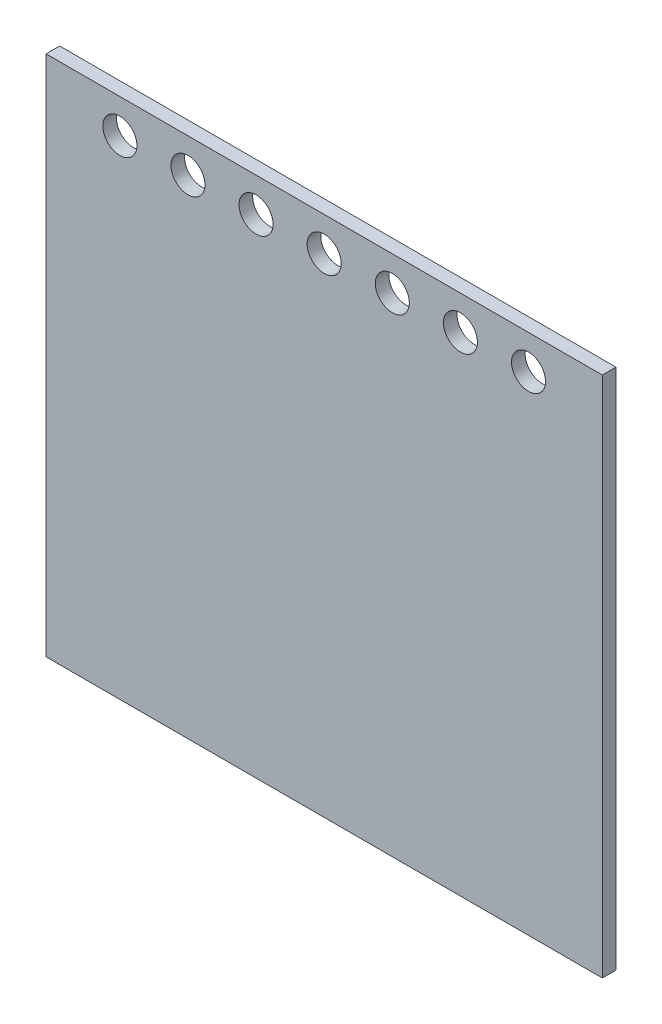
ISO-10303-21;
HEADER;
FILE_DESCRIPTION(('STEP AP214'),'2;1');
FILE_NAME('part.step','',(''),(''),'','','');
FILE_SCHEMA(('AUTOMOTIVE_DESIGN { 1 0 10303 214 1 1 1 1 }'));
ENDSEC;
DATA;
#1=APPLICATION_CONTEXT('core data for automotive mechanical design processes');
#2=APPLICATION_PROTOCOL_DEFINITION('international standard','automotive_design',2000,#1);
#3=PRODUCT_CONTEXT('',#1,'mechanical');
#4=PRODUCT('Part','Part','',(#3));
#5=PRODUCT_RELATED_PRODUCT_CATEGORY('part','',(#4));
#6=PRODUCT_DEFINITION_FORMATION('','',#4);
#7=PRODUCT_DEFINITION_CONTEXT('part definition',#1,'design');
#8=PRODUCT_DEFINITION('design','',#6,#7);
#9=PRODUCT_DEFINITION_SHAPE('','',#8);
#10=(LENGTH_UNIT() NAMED_UNIT(*) SI_UNIT(.MILLI.,.METRE.));
#11=(NAMED_UNIT(*) PLANE_ANGLE_UNIT() SI_UNIT($,.RADIAN.));
#12=(NAMED_UNIT(*) SI_UNIT($,.STERADIAN.) SOLID_ANGLE_UNIT());
#13=UNCERTAINTY_MEASURE_WITH_UNIT(LENGTH_MEASURE(1.E-05),#10,'distance_accuracy_value','');
#14=(GEOMETRIC_REPRESENTATION_CONTEXT(3) GLOBAL_UNCERTAINTY_ASSIGNED_CONTEXT((#13)) GLOBAL_UNIT_ASSIGNED_CONTEXT((#10,
#11,#12)) REPRESENTATION_CONTEXT('',''));
#15=CARTESIAN_POINT('',(0.,0.,0.));
#16=DIRECTION('',(0.,0.,1.));
#17=DIRECTION('',(1.,0.,0.));
#18=AXIS2_PLACEMENT_3D('',#15,#16,#17);
#19=CARTESIAN_POINT('',(0.,0.,18.));
#20=DIRECTION('',(0.,0.,-1.));
#21=DIRECTION('',(-1.,0.,0.));
#22=AXIS2_PLACEMENT_3D('',#19,#20,#21);
#23=PLANE('',#22);
#24=DIRECTION('',(0.,1.,0.));
#25=VECTOR('',#24,1.);
#26=CARTESIAN_POINT('',(367.5,-345.,18.));
#27=LINE('',#26,#25);
#28=CARTESIAN_POINT('',(367.5,-345.,18.));
#29=VERTEX_POINT('',#28);
#30=CARTESIAN_POINT('',(367.5,345.,18.));
#31=VERTEX_POINT('',#30);
#32=EDGE_CURVE('E87',#29,#31,#27,.T.);
#33=ORIENTED_EDGE('',*,*,#32,.T.);
#34=DIRECTION('',(-1.,0.,0.));
#35=VECTOR('',#34,1.);
#36=CARTESIAN_POINT('',(-367.5,345.,18.));
#37=LINE('',#36,#35);
#38=CARTESIAN_POINT('',(-367.5,345.,18.));
#39=VERTEX_POINT('',#38);
#40=EDGE_CURVE('E82',#31,#39,#37,.T.);
#41=ORIENTED_EDGE('',*,*,#40,.T.);
#42=DIRECTION('',(0.,-1.,0.));
#43=VECTOR('',#42,1.);
#44=CARTESIAN_POINT('',(-367.5,-345.,18.));
#45=LINE('',#44,#43);
#46=CARTESIAN_POINT('',(-367.5,-345.,18.));
#47=VERTEX_POINT('',#46);
#48=EDGE_CURVE('E85',#39,#47,#45,.T.);
#49=ORIENTED_EDGE('',*,*,#48,.T.);
#50=DIRECTION('',(1.,0.,0.));
#51=VECTOR('',#50,1.);
#52=CARTESIAN_POINT('',(-367.5,-345.,18.));
#53=LINE('',#52,#51);
#54=EDGE_CURVE('E52',#47,#29,#53,.T.);
#55=ORIENTED_EDGE('',*,*,#54,.T.);
#56=EDGE_LOOP('',(#33,#41,#49,#55));
#57=FACE_BOUND('',#56,.T.);
#58=CARTESIAN_POINT('',(0.,300.,18.));
#59=DIRECTION('',(0.,0.,1.));
#60=DIRECTION('',(1.,0.,0.));
#61=AXIS2_PLACEMENT_3D('',#58,#59,#60);
#62=CIRCLE('',#61,22.5);
#63=CARTESIAN_POINT('',(22.5,300.,18.));
#64=VERTEX_POINT('',#63);
#65=EDGE_CURVE('E102',#64,#64,#62,.T.);
#66=ORIENTED_EDGE('',*,*,#65,.F.);
#67=EDGE_LOOP('',(#66));
#68=FACE_BOUND('',#67,.T.);
#69=CARTESIAN_POINT('',(90.,300.,18.));
#70=DIRECTION('',(0.,0.,1.));
#71=DIRECTION('',(1.,0.,0.));
#72=AXIS2_PLACEMENT_3D('',#69,#70,#71);
#73=CIRCLE('',#72,22.5);
#74=CARTESIAN_POINT('',(112.5,300.,18.));
#75=VERTEX_POINT('',#74);
#76=EDGE_CURVE('E117',#75,#75,#73,.T.);
#77=ORIENTED_EDGE('',*,*,#76,.F.);
#78=EDGE_LOOP('',(#77));
#79=FACE_BOUND('',#78,.T.);
#80=CARTESIAN_POINT('',(180.,300.,18.));
#81=DIRECTION('',(0.,0.,1.));
#82=DIRECTION('',(1.,0.,0.));
#83=AXIS2_PLACEMENT_3D('',#80,#81,#82);
#84=CIRCLE('',#83,22.5);
#85=CARTESIAN_POINT('',(202.5,300.,18.));
#86=VERTEX_POINT('',#85);
#87=EDGE_CURVE('E123',#86,#86,#84,.T.);
#88=ORIENTED_EDGE('',*,*,#87,.F.);
#89=EDGE_LOOP('',(#88));
#90=FACE_BOUND('',#89,.T.);
#91=CARTESIAN_POINT('',(270.,300.,18.));
#92=DIRECTION('',(0.,0.,1.));
#93=DIRECTION('',(1.,0.,0.));
#94=AXIS2_PLACEMENT_3D('',#91,#92,#93);
#95=CIRCLE('',#94,22.5);
#96=CARTESIAN_POINT('',(292.5,300.,18.));
#97=VERTEX_POINT('',#96);
#98=EDGE_CURVE('E129',#97,#97,#95,.T.);
#99=ORIENTED_EDGE('',*,*,#98,.F.);
#100=EDGE_LOOP('',(#99));
#101=FACE_BOUND('',#100,.T.);
#102=CARTESIAN_POINT('',(-90.,299.999999999999,18.));
#103=DIRECTION('',(0.,0.,1.));
#104=DIRECTION('',(1.,0.,0.));
#105=AXIS2_PLACEMENT_3D('',#102,#103,#104);
#106=CIRCLE('',#105,22.5);
#107=CARTESIAN_POINT('',(-67.5,299.999999999999,18.));
#108=VERTEX_POINT('',#107);
#109=EDGE_CURVE('E135',#108,#108,#106,.T.);
#110=ORIENTED_EDGE('',*,*,#109,.F.);
#111=EDGE_LOOP('',(#110));
#112=FACE_BOUND('',#111,.T.);
#113=CARTESIAN_POINT('',(-180.,299.999999999999,18.));
#114=DIRECTION('',(0.,0.,1.));
#115=DIRECTION('',(1.,0.,0.));
#116=AXIS2_PLACEMENT_3D('',#113,#114,#115);
#117=CIRCLE('',#116,22.5);
#118=CARTESIAN_POINT('',(-157.5,299.999999999999,18.));
#119=VERTEX_POINT('',#118);
#120=EDGE_CURVE('E141',#119,#119,#117,.T.);
#121=ORIENTED_EDGE('',*,*,#120,.F.);
#122=EDGE_LOOP('',(#121));
#123=FACE_BOUND('',#122,.T.);
#124=CARTESIAN_POINT('',(-270.,299.999999999998,18.));
#125=DIRECTION('',(0.,0.,1.));
#126=DIRECTION('',(1.,0.,0.));
#127=AXIS2_PLACEMENT_3D('',#124,#125,#126);
#128=CIRCLE('',#127,22.5);
#129=CARTESIAN_POINT('',(-247.5,299.999999999998,18.));
#130=VERTEX_POINT('',#129);
#131=EDGE_CURVE('E147',#130,#130,#128,.T.);
#132=ORIENTED_EDGE('',*,*,#131,.F.);
#133=EDGE_LOOP('',(#132));
#134=FACE_BOUND('',#133,.T.);
#135=ADVANCED_FACE('F35',(#57,#68,#79,#90,#101,#112,#123,#134),#23,.F.);
#136=CARTESIAN_POINT('',(0.,0.,0.));
#137=DIRECTION('',(0.,0.,-1.));
#138=DIRECTION('',(-1.,0.,0.));
#139=AXIS2_PLACEMENT_3D('',#136,#137,#138);
#140=PLANE('',#139);
#141=CARTESIAN_POINT('',(-180.,299.999999999999,0.));
#142=DIRECTION('',(0.,0.,1.));
#143=DIRECTION('',(1.,0.,0.));
#144=AXIS2_PLACEMENT_3D('',#141,#142,#143);
#145=CIRCLE('',#144,22.5);
#146=CARTESIAN_POINT('',(-157.5,299.999999999999,0.));
#147=VERTEX_POINT('',#146);
#148=EDGE_CURVE('E144',#147,#147,#145,.T.);
#149=ORIENTED_EDGE('',*,*,#148,.T.);
#150=EDGE_LOOP('',(#149));
#151=FACE_BOUND('',#150,.T.);
#152=CARTESIAN_POINT('',(270.,300.,0.));
#153=DIRECTION('',(0.,0.,1.));
#154=DIRECTION('',(1.,0.,0.));
#155=AXIS2_PLACEMENT_3D('',#152,#153,#154);
#156=CIRCLE('',#155,22.5);
#157=CARTESIAN_POINT('',(292.5,300.,0.));
#158=VERTEX_POINT('',#157);
#159=EDGE_CURVE('E132',#158,#158,#156,.T.);
#160=ORIENTED_EDGE('',*,*,#159,.T.);
#161=EDGE_LOOP('',(#160));
#162=FACE_BOUND('',#161,.T.);
#163=CARTESIAN_POINT('',(90.,300.,0.));
#164=DIRECTION('',(0.,0.,1.));
#165=DIRECTION('',(1.,0.,0.));
#166=AXIS2_PLACEMENT_3D('',#163,#164,#165);
#167=CIRCLE('',#166,22.5);
#168=CARTESIAN_POINT('',(112.5,300.,0.));
#169=VERTEX_POINT('',#168);
#170=EDGE_CURVE('E120',#169,#169,#167,.T.);
#171=ORIENTED_EDGE('',*,*,#170,.T.);
#172=EDGE_LOOP('',(#171));
#173=FACE_BOUND('',#172,.T.);
#174=DIRECTION('',(0.,1.,0.));
#175=VECTOR('',#174,1.);
#176=CARTESIAN_POINT('',(367.5,-345.,0.));
#177=LINE('',#176,#175);
#178=CARTESIAN_POINT('',(367.5,-345.,0.));
#179=VERTEX_POINT('',#178);
#180=CARTESIAN_POINT('',(367.5,345.,0.));
#181=VERTEX_POINT('',#180);
#182=EDGE_CURVE('E99',#179,#181,#177,.T.);
#183=ORIENTED_EDGE('',*,*,#182,.F.);
#184=DIRECTION('',(1.,0.,0.));
#185=VECTOR('',#184,1.);
#186=CARTESIAN_POINT('',(-367.5,-345.,0.));
#187=LINE('',#186,#185);
#188=CARTESIAN_POINT('',(-367.5,-345.,0.));
#189=VERTEX_POINT('',#188);
#190=EDGE_CURVE('E75',#189,#179,#187,.T.);
#191=ORIENTED_EDGE('',*,*,#190,.F.);
#192=DIRECTION('',(0.,-1.,0.));
#193=VECTOR('',#192,1.);
#194=CARTESIAN_POINT('',(-367.5,-345.,0.));
#195=LINE('',#194,#193);
#196=CARTESIAN_POINT('',(-367.5,345.,0.));
#197=VERTEX_POINT('',#196);
#198=EDGE_CURVE('E69',#197,#189,#195,.T.);
#199=ORIENTED_EDGE('',*,*,#198,.F.);
#200=DIRECTION('',(-1.,0.,0.));
#201=VECTOR('',#200,1.);
#202=CARTESIAN_POINT('',(-367.5,345.,0.));
#203=LINE('',#202,#201);
#204=EDGE_CURVE('E91',#181,#197,#203,.T.);
#205=ORIENTED_EDGE('',*,*,#204,.F.);
#206=EDGE_LOOP('',(#183,#191,#199,#205));
#207=FACE_BOUND('',#206,.T.);
#208=CARTESIAN_POINT('',(0.,300.,0.));
#209=DIRECTION('',(0.,0.,1.));
#210=DIRECTION('',(1.,0.,0.));
#211=AXIS2_PLACEMENT_3D('',#208,#209,#210);
#212=CIRCLE('',#211,22.5);
#213=CARTESIAN_POINT('',(22.5,300.,0.));
#214=VERTEX_POINT('',#213);
#215=EDGE_CURVE('E114',#214,#214,#212,.T.);
#216=ORIENTED_EDGE('',*,*,#215,.T.);
#217=EDGE_LOOP('',(#216));
#218=FACE_BOUND('',#217,.T.);
#219=CARTESIAN_POINT('',(180.,300.,0.));
#220=DIRECTION('',(0.,0.,1.));
#221=DIRECTION('',(1.,0.,0.));
#222=AXIS2_PLACEMENT_3D('',#219,#220,#221);
#223=CIRCLE('',#222,22.5);
#224=CARTESIAN_POINT('',(202.5,300.,0.));
#225=VERTEX_POINT('',#224);
#226=EDGE_CURVE('E126',#225,#225,#223,.T.);
#227=ORIENTED_EDGE('',*,*,#226,.T.);
#228=EDGE_LOOP('',(#227));
#229=FACE_BOUND('',#228,.T.);
#230=CARTESIAN_POINT('',(-90.,299.999999999999,0.));
#231=DIRECTION('',(0.,0.,1.));
#232=DIRECTION('',(1.,0.,0.));
#233=AXIS2_PLACEMENT_3D('',#230,#231,#232);
#234=CIRCLE('',#233,22.5);
#235=CARTESIAN_POINT('',(-67.5,299.999999999999,0.));
#236=VERTEX_POINT('',#235);
#237=EDGE_CURVE('E138',#236,#236,#234,.T.);
#238=ORIENTED_EDGE('',*,*,#237,.T.);
#239=EDGE_LOOP('',(#238));
#240=FACE_BOUND('',#239,.T.);
#241=CARTESIAN_POINT('',(-270.,299.999999999998,0.));
#242=DIRECTION('',(0.,0.,1.));
#243=DIRECTION('',(1.,0.,0.));
#244=AXIS2_PLACEMENT_3D('',#241,#242,#243);
#245=CIRCLE('',#244,22.5);
#246=CARTESIAN_POINT('',(-247.5,299.999999999998,0.));
#247=VERTEX_POINT('',#246);
#248=EDGE_CURVE('E150',#247,#247,#245,.T.);
#249=ORIENTED_EDGE('',*,*,#248,.T.);
#250=EDGE_LOOP('',(#249));
#251=FACE_BOUND('',#250,.T.);
#252=ADVANCED_FACE('F110',(#151,#162,#173,#207,#218,#229,#240,#251),#140,.T.);
#253=CARTESIAN_POINT('',(367.5,-345.,18.));
#254=DIRECTION('',(-1.,0.,0.));
#255=DIRECTION('',(0.,0.,1.));
#256=AXIS2_PLACEMENT_3D('',#253,#254,#255);
#257=PLANE('',#256);
#258=ORIENTED_EDGE('',*,*,#182,.T.);
#259=DIRECTION('',(0.,0.,-1.));
#260=VECTOR('',#259,1.);
#261=CARTESIAN_POINT('',(367.5,345.,18.));
#262=LINE('',#261,#260);
#263=EDGE_CURVE('E11',#31,#181,#262,.T.);
#264=ORIENTED_EDGE('',*,*,#263,.F.);
#265=ORIENTED_EDGE('',*,*,#32,.F.);
#266=DIRECTION('',(0.,0.,-1.));
#267=VECTOR('',#266,1.);
#268=CARTESIAN_POINT('',(367.5,-345.,18.));
#269=LINE('',#268,#267);
#270=EDGE_CURVE('E95',#29,#179,#269,.T.);
#271=ORIENTED_EDGE('',*,*,#270,.T.);
#272=EDGE_LOOP('',(#258,#264,#265,#271));
#273=FACE_BOUND('',#272,.T.);
#274=ADVANCED_FACE('F37',(#273),#257,.F.);
#275=CARTESIAN_POINT('',(-367.5,345.,18.));
#276=DIRECTION('',(0.,-1.,0.));
#277=DIRECTION('',(0.,0.,-1.));
#278=AXIS2_PLACEMENT_3D('',#275,#276,#277);
#279=PLANE('',#278);
#280=ORIENTED_EDGE('',*,*,#204,.T.);
#281=DIRECTION('',(0.,0.,-1.));
#282=VECTOR('',#281,1.);
#283=CARTESIAN_POINT('',(-367.5,345.,18.));
#284=LINE('',#283,#282);
#285=EDGE_CURVE('E44',#39,#197,#284,.T.);
#286=ORIENTED_EDGE('',*,*,#285,.F.);
#287=ORIENTED_EDGE('',*,*,#40,.F.);
#288=ORIENTED_EDGE('',*,*,#263,.T.);
#289=EDGE_LOOP('',(#280,#286,#287,#288));
#290=FACE_BOUND('',#289,.T.);
#291=ADVANCED_FACE('F90',(#290),#279,.F.);
#292=CARTESIAN_POINT('',(-367.5,-345.,18.));
#293=DIRECTION('',(1.,0.,0.));
#294=DIRECTION('',(0.,0.,-1.));
#295=AXIS2_PLACEMENT_3D('',#292,#293,#294);
#296=PLANE('',#295);
#297=ORIENTED_EDGE('',*,*,#198,.T.);
#298=DIRECTION('',(0.,0.,-1.));
#299=VECTOR('',#298,1.);
#300=CARTESIAN_POINT('',(-367.5,-345.,18.));
#301=LINE('',#300,#299);
#302=EDGE_CURVE('E92',#47,#189,#301,.T.);
#303=ORIENTED_EDGE('',*,*,#302,.F.);
#304=ORIENTED_EDGE('',*,*,#48,.F.);
#305=ORIENTED_EDGE('',*,*,#285,.T.);
#306=EDGE_LOOP('',(#297,#303,#304,#305));
#307=FACE_BOUND('',#306,.T.);
#308=ADVANCED_FACE('F93',(#307),#296,.F.);
#309=CARTESIAN_POINT('',(-367.5,-345.,18.));
#310=DIRECTION('',(0.,1.,0.));
#311=DIRECTION('',(0.,0.,1.));
#312=AXIS2_PLACEMENT_3D('',#309,#310,#311);
#313=PLANE('',#312);
#314=ORIENTED_EDGE('',*,*,#190,.T.);
#315=ORIENTED_EDGE('',*,*,#270,.F.);
#316=ORIENTED_EDGE('',*,*,#54,.F.);
#317=ORIENTED_EDGE('',*,*,#302,.T.);
#318=EDGE_LOOP('',(#314,#315,#316,#317));
#319=FACE_BOUND('',#318,.T.);
#320=ADVANCED_FACE('F107',(#319),#313,.F.);
#321=CARTESIAN_POINT('',(0.,300.,18.));
#322=DIRECTION('',(0.,0.,-1.));
#323=DIRECTION('',(-1.,0.,0.));
#324=AXIS2_PLACEMENT_3D('',#321,#322,#323);
#325=CYLINDRICAL_SURFACE('',#324,22.5);
#326=ORIENTED_EDGE('',*,*,#65,.T.);
#327=EDGE_LOOP('',(#326));
#328=FACE_BOUND('',#327,.T.);
#329=ORIENTED_EDGE('',*,*,#215,.F.);
#330=EDGE_LOOP('',(#329));
#331=FACE_BOUND('',#330,.T.);
#332=ADVANCED_FACE('F167',(#328,#331),#325,.F.);
#333=CARTESIAN_POINT('',(90.,300.,18.));
#334=DIRECTION('',(0.,0.,-1.));
#335=DIRECTION('',(-1.,0.,0.));
#336=AXIS2_PLACEMENT_3D('',#333,#334,#335);
#337=CYLINDRICAL_SURFACE('',#336,22.5);
#338=ORIENTED_EDGE('',*,*,#76,.T.);
#339=EDGE_LOOP('',(#338));
#340=FACE_BOUND('',#339,.T.);
#341=ORIENTED_EDGE('',*,*,#170,.F.);
#342=EDGE_LOOP('',(#341));
#343=FACE_BOUND('',#342,.T.);
#344=ADVANCED_FACE('F221',(#340,#343),#337,.F.);
#345=CARTESIAN_POINT('',(180.,300.,18.));
#346=DIRECTION('',(0.,0.,-1.));
#347=DIRECTION('',(-1.,0.,0.));
#348=AXIS2_PLACEMENT_3D('',#345,#346,#347);
#349=CYLINDRICAL_SURFACE('',#348,22.5);
#350=ORIENTED_EDGE('',*,*,#87,.T.);
#351=EDGE_LOOP('',(#350));
#352=FACE_BOUND('',#351,.T.);
#353=ORIENTED_EDGE('',*,*,#226,.F.);
#354=EDGE_LOOP('',(#353));
#355=FACE_BOUND('',#354,.T.);
#356=ADVANCED_FACE('F232',(#352,#355),#349,.F.);
#357=CARTESIAN_POINT('',(270.,300.,18.));
#358=DIRECTION('',(0.,0.,-1.));
#359=DIRECTION('',(-1.,0.,0.));
#360=AXIS2_PLACEMENT_3D('',#357,#358,#359);
#361=CYLINDRICAL_SURFACE('',#360,22.5);
#362=ORIENTED_EDGE('',*,*,#98,.T.);
#363=EDGE_LOOP('',(#362));
#364=FACE_BOUND('',#363,.T.);
#365=ORIENTED_EDGE('',*,*,#159,.F.);
#366=EDGE_LOOP('',(#365));
#367=FACE_BOUND('',#366,.T.);
#368=ADVANCED_FACE('F242',(#364,#367),#361,.F.);
#369=CARTESIAN_POINT('',(-90.,299.999999999999,18.));
#370=DIRECTION('',(0.,0.,-1.));
#371=DIRECTION('',(-1.,0.,0.));
#372=AXIS2_PLACEMENT_3D('',#369,#370,#371);
#373=CYLINDRICAL_SURFACE('',#372,22.5);
#374=ORIENTED_EDGE('',*,*,#109,.T.);
#375=EDGE_LOOP('',(#374));
#376=FACE_BOUND('',#375,.T.);
#377=ORIENTED_EDGE('',*,*,#237,.F.);
#378=EDGE_LOOP('',(#377));
#379=FACE_BOUND('',#378,.T.);
#380=ADVANCED_FACE('F252',(#376,#379),#373,.F.);
#381=CARTESIAN_POINT('',(-180.,299.999999999999,18.));
#382=DIRECTION('',(0.,0.,-1.));
#383=DIRECTION('',(-1.,0.,0.));
#384=AXIS2_PLACEMENT_3D('',#381,#382,#383);
#385=CYLINDRICAL_SURFACE('',#384,22.5);
#386=ORIENTED_EDGE('',*,*,#120,.T.);
#387=EDGE_LOOP('',(#386));
#388=FACE_BOUND('',#387,.T.);
#389=ORIENTED_EDGE('',*,*,#148,.F.);
#390=EDGE_LOOP('',(#389));
#391=FACE_BOUND('',#390,.T.);
#392=ADVANCED_FACE('F262',(#388,#391),#385,.F.);
#393=CARTESIAN_POINT('',(-270.,299.999999999998,18.));
#394=DIRECTION('',(0.,0.,-1.));
#395=DIRECTION('',(-1.,0.,0.));
#396=AXIS2_PLACEMENT_3D('',#393,#394,#395);
#397=CYLINDRICAL_SURFACE('',#396,22.5);
#398=ORIENTED_EDGE('',*,*,#131,.T.);
#399=EDGE_LOOP('',(#398));
#400=FACE_BOUND('',#399,.T.);
#401=ORIENTED_EDGE('',*,*,#248,.F.);
#402=EDGE_LOOP('',(#401));
#403=FACE_BOUND('',#402,.T.);
#404=ADVANCED_FACE('F156',(#400,#403),#397,.F.);
#405=CLOSED_SHELL('',(#135,#252,#274,#291,#308,#320,#332,#344,#356,#368,#380,#392,#404));
#406=MANIFOLD_SOLID_BREP('B2',#405);
#407=ADVANCED_BREP_SHAPE_REPRESENTATION('',(#18,#406),#14);
#408=SHAPE_DEFINITION_REPRESENTATION(#9,#407);
ENDSEC;
END-ISO-10303-21;
